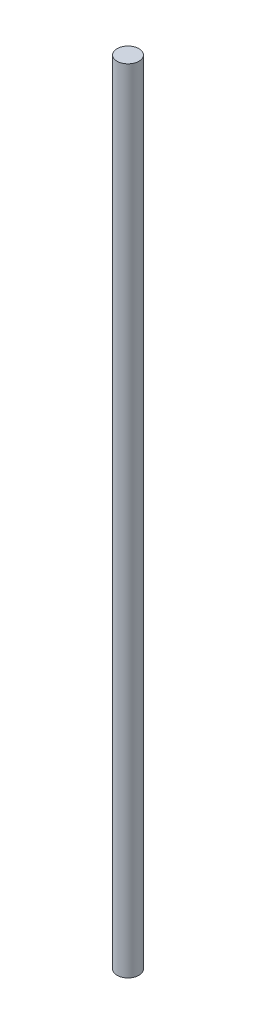
ISO-10303-21;
HEADER;
FILE_DESCRIPTION(('STEP AP214'),'2;1');
FILE_NAME('part.step','',(''),(''),'','','');
FILE_SCHEMA(('AUTOMOTIVE_DESIGN { 1 0 10303 214 1 1 1 1 }'));
ENDSEC;
DATA;
#1=APPLICATION_CONTEXT('core data for automotive mechanical design processes');
#2=APPLICATION_PROTOCOL_DEFINITION('international standard','automotive_design',2000,#1);
#3=PRODUCT_CONTEXT('',#1,'mechanical');
#4=PRODUCT('Part','Part','',(#3));
#5=PRODUCT_RELATED_PRODUCT_CATEGORY('part','',(#4));
#6=PRODUCT_DEFINITION_FORMATION('','',#4);
#7=PRODUCT_DEFINITION_CONTEXT('part definition',#1,'design');
#8=PRODUCT_DEFINITION('design','',#6,#7);
#9=PRODUCT_DEFINITION_SHAPE('','',#8);
#10=(LENGTH_UNIT() NAMED_UNIT(*) SI_UNIT(.MILLI.,.METRE.));
#11=(NAMED_UNIT(*) PLANE_ANGLE_UNIT() SI_UNIT($,.RADIAN.));
#12=(NAMED_UNIT(*) SI_UNIT($,.STERADIAN.) SOLID_ANGLE_UNIT());
#13=UNCERTAINTY_MEASURE_WITH_UNIT(LENGTH_MEASURE(1.E-05),#10,'distance_accuracy_value','');
#14=(GEOMETRIC_REPRESENTATION_CONTEXT(3) GLOBAL_UNCERTAINTY_ASSIGNED_CONTEXT((#13)) GLOBAL_UNIT_ASSIGNED_CONTEXT((#10,
#11,#12)) REPRESENTATION_CONTEXT('',''));
#15=CARTESIAN_POINT('',(0.,0.,0.));
#16=DIRECTION('',(0.,0.,1.));
#17=DIRECTION('',(1.,0.,0.));
#18=AXIS2_PLACEMENT_3D('',#15,#16,#17);
#19=CARTESIAN_POINT('',(0.,127.,0.));
#20=DIRECTION('',(0.,-1.,0.));
#21=DIRECTION('',(0.,0.,-1.));
#22=AXIS2_PLACEMENT_3D('',#19,#20,#21);
#23=CYLINDRICAL_SURFACE('',#22,1.7526);
#24=CARTESIAN_POINT('',(0.,127.,0.));
#25=DIRECTION('',(0.,1.,0.));
#26=DIRECTION('',(0.,0.,1.));
#27=AXIS2_PLACEMENT_3D('',#24,#25,#26);
#28=CIRCLE('',#27,1.7526);
#29=CARTESIAN_POINT('',(0.,127.,1.7526));
#30=VERTEX_POINT('',#29);
#31=EDGE_CURVE('E10',#30,#30,#28,.T.);
#32=ORIENTED_EDGE('',*,*,#31,.F.);
#33=EDGE_LOOP('',(#32));
#34=FACE_BOUND('',#33,.T.);
#35=CARTESIAN_POINT('',(0.,0.,0.));
#36=DIRECTION('',(0.,1.,0.));
#37=DIRECTION('',(0.,0.,1.));
#38=AXIS2_PLACEMENT_3D('',#35,#36,#37);
#39=CIRCLE('',#38,1.7526);
#40=CARTESIAN_POINT('',(0.,0.,1.7526));
#41=VERTEX_POINT('',#40);
#42=EDGE_CURVE('E44',#41,#41,#39,.T.);
#43=ORIENTED_EDGE('',*,*,#42,.T.);
#44=EDGE_LOOP('',(#43));
#45=FACE_BOUND('',#44,.T.);
#46=ADVANCED_FACE('F41',(#34,#45),#23,.T.);
#47=CARTESIAN_POINT('',(0.,127.,0.));
#48=DIRECTION('',(0.,1.,0.));
#49=DIRECTION('',(0.,0.,1.));
#50=AXIS2_PLACEMENT_3D('',#47,#48,#49);
#51=PLANE('',#50);
#52=ORIENTED_EDGE('',*,*,#31,.T.);
#53=EDGE_LOOP('',(#52));
#54=FACE_BOUND('',#53,.T.);
#55=ADVANCED_FACE('F58',(#54),#51,.T.);
#56=CARTESIAN_POINT('',(0.,0.,0.));
#57=DIRECTION('',(0.,1.,0.));
#58=DIRECTION('',(0.,0.,1.));
#59=AXIS2_PLACEMENT_3D('',#56,#57,#58);
#60=PLANE('',#59);
#61=ORIENTED_EDGE('',*,*,#42,.F.);
#62=EDGE_LOOP('',(#61));
#63=FACE_BOUND('',#62,.T.);
#64=ADVANCED_FACE('F56',(#63),#60,.F.);
#65=CLOSED_SHELL('',(#46,#55,#64));
#66=MANIFOLD_SOLID_BREP('B2',#65);
#67=ADVANCED_BREP_SHAPE_REPRESENTATION('',(#18,#66),#14);
#68=SHAPE_DEFINITION_REPRESENTATION(#9,#67);
ENDSEC;
END-ISO-10303-21;
